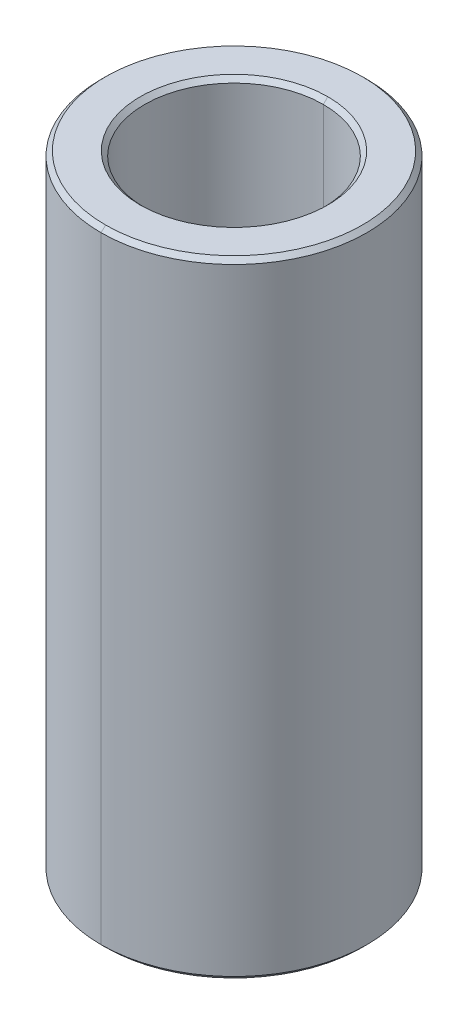
ISO-10303-21;
HEADER;
FILE_DESCRIPTION(('STEP AP214'),'2;1');
FILE_NAME('part.step','',(''),(''),'','','');
FILE_SCHEMA(('AUTOMOTIVE_DESIGN { 1 0 10303 214 1 1 1 1 }'));
ENDSEC;
DATA;
#1=APPLICATION_CONTEXT('core data for automotive mechanical design processes');
#2=APPLICATION_PROTOCOL_DEFINITION('international standard','automotive_design',2000,#1);
#3=PRODUCT_CONTEXT('',#1,'mechanical');
#4=PRODUCT('Part','Part','',(#3));
#5=PRODUCT_RELATED_PRODUCT_CATEGORY('part','',(#4));
#6=PRODUCT_DEFINITION_FORMATION('','',#4);
#7=PRODUCT_DEFINITION_CONTEXT('part definition',#1,'design');
#8=PRODUCT_DEFINITION('design','',#6,#7);
#9=PRODUCT_DEFINITION_SHAPE('','',#8);
#10=(LENGTH_UNIT() NAMED_UNIT(*) SI_UNIT(.MILLI.,.METRE.));
#11=(NAMED_UNIT(*) PLANE_ANGLE_UNIT() SI_UNIT($,.RADIAN.));
#12=(NAMED_UNIT(*) SI_UNIT($,.STERADIAN.) SOLID_ANGLE_UNIT());
#13=UNCERTAINTY_MEASURE_WITH_UNIT(LENGTH_MEASURE(1.E-05),#10,'distance_accuracy_value','');
#14=(GEOMETRIC_REPRESENTATION_CONTEXT(3) GLOBAL_UNCERTAINTY_ASSIGNED_CONTEXT((#13)) GLOBAL_UNIT_ASSIGNED_CONTEXT((#10,
#11,#12)) REPRESENTATION_CONTEXT('',''));
#15=CARTESIAN_POINT('',(0.,0.,0.));
#16=DIRECTION('',(0.,0.,1.));
#17=DIRECTION('',(1.,0.,0.));
#18=AXIS2_PLACEMENT_3D('',#15,#16,#17);
#19=CARTESIAN_POINT('',(0.,6.9,0.));
#20=DIRECTION('',(0.,1.,0.));
#21=DIRECTION('',(0.,0.,1.));
#22=AXIS2_PLACEMENT_3D('',#19,#20,#21);
#23=CONICAL_SURFACE('',#22,2.,0.785398163397448);
#24=DIRECTION('',(0.,0.707106781186548,-0.707106781186548));
#25=VECTOR('',#24,1.);
#26=CARTESIAN_POINT('',(0.,6.9,-2.));
#27=LINE('',#26,#25);
#28=CARTESIAN_POINT('',(0.,6.9,-2.));
#29=VERTEX_POINT('',#28);
#30=CARTESIAN_POINT('',(0.,7.,-2.1));
#31=VERTEX_POINT('',#30);
#32=EDGE_CURVE('E135',#29,#31,#27,.T.);
#33=ORIENTED_EDGE('',*,*,#32,.F.);
#34=CARTESIAN_POINT('',(0.,6.9,0.));
#35=DIRECTION('',(0.,1.,0.));
#36=DIRECTION('',(0.,0.,1.));
#37=AXIS2_PLACEMENT_3D('',#34,#35,#36);
#38=CIRCLE('',#37,2.);
#39=CARTESIAN_POINT('',(0.,6.9,2.));
#40=VERTEX_POINT('',#39);
#41=EDGE_CURVE('E26',#40,#29,#38,.T.);
#42=ORIENTED_EDGE('',*,*,#41,.F.);
#43=DIRECTION('',(0.,0.707106781186548,0.707106781186548));
#44=VECTOR('',#43,1.);
#45=CARTESIAN_POINT('',(0.,6.9,2.));
#46=LINE('',#45,#44);
#47=CARTESIAN_POINT('',(0.,7.,2.1));
#48=VERTEX_POINT('',#47);
#49=EDGE_CURVE('E126',#40,#48,#46,.T.);
#50=ORIENTED_EDGE('',*,*,#49,.T.);
#51=CARTESIAN_POINT('',(0.,7.,0.));
#52=DIRECTION('',(0.,-1.,0.));
#53=DIRECTION('',(0.,0.,1.));
#54=AXIS2_PLACEMENT_3D('',#51,#52,#53);
#55=CIRCLE('',#54,2.1);
#56=EDGE_CURVE('E112',#31,#48,#55,.T.);
#57=ORIENTED_EDGE('',*,*,#56,.F.);
#58=EDGE_LOOP('',(#33,#42,#50,#57));
#59=FACE_BOUND('',#58,.T.);
#60=ADVANCED_FACE('F15',(#59),#23,.F.);
#61=CARTESIAN_POINT('',(0.,-7.,0.));
#62=DIRECTION('',(0.,-1.,0.));
#63=DIRECTION('',(0.,0.,-1.));
#64=AXIS2_PLACEMENT_3D('',#61,#62,#63);
#65=CONICAL_SURFACE('',#64,2.1,0.785398163397457);
#66=DIRECTION('',(0.,-0.707106781186542,0.707106781186554));
#67=VECTOR('',#66,1.);
#68=CARTESIAN_POINT('',(0.,-7.,2.1));
#69=LINE('',#68,#67);
#70=CARTESIAN_POINT('',(0.,-6.9,2.));
#71=VERTEX_POINT('',#70);
#72=CARTESIAN_POINT('',(0.,-7.,2.1));
#73=VERTEX_POINT('',#72);
#74=EDGE_CURVE('E151',#71,#73,#69,.T.);
#75=ORIENTED_EDGE('',*,*,#74,.F.);
#76=CARTESIAN_POINT('',(0.,-6.9,0.));
#77=DIRECTION('',(0.,-1.,0.));
#78=DIRECTION('',(0.,0.,1.));
#79=AXIS2_PLACEMENT_3D('',#76,#77,#78);
#80=CIRCLE('',#79,2.);
#81=CARTESIAN_POINT('',(0.,-6.9,-2.));
#82=VERTEX_POINT('',#81);
#83=EDGE_CURVE('E10',#82,#71,#80,.T.);
#84=ORIENTED_EDGE('',*,*,#83,.F.);
#85=DIRECTION('',(0.,-0.707106781186542,-0.707106781186554));
#86=VECTOR('',#85,1.);
#87=CARTESIAN_POINT('',(0.,-7.,-2.1));
#88=LINE('',#87,#86);
#89=CARTESIAN_POINT('',(0.,-7.,-2.1));
#90=VERTEX_POINT('',#89);
#91=EDGE_CURVE('E150',#82,#90,#88,.T.);
#92=ORIENTED_EDGE('',*,*,#91,.T.);
#93=CARTESIAN_POINT('',(0.,-7.,0.));
#94=DIRECTION('',(0.,1.,0.));
#95=DIRECTION('',(0.,0.,1.));
#96=AXIS2_PLACEMENT_3D('',#93,#94,#95);
#97=CIRCLE('',#96,2.1);
#98=EDGE_CURVE('E80',#73,#90,#97,.T.);
#99=ORIENTED_EDGE('',*,*,#98,.F.);
#100=EDGE_LOOP('',(#75,#84,#92,#99));
#101=FACE_BOUND('',#100,.T.);
#102=ADVANCED_FACE('F17',(#101),#65,.F.);
#103=CARTESIAN_POINT('',(0.,7.,0.));
#104=DIRECTION('',(0.,-1.,0.));
#105=DIRECTION('',(0.,0.,-1.));
#106=AXIS2_PLACEMENT_3D('',#103,#104,#105);
#107=CONICAL_SURFACE('',#106,2.875,0.785398163397448);
#108=DIRECTION('',(0.,-0.707106781186548,0.707106781186548));
#109=VECTOR('',#108,1.);
#110=CARTESIAN_POINT('',(0.,7.,2.875));
#111=LINE('',#110,#109);
#112=CARTESIAN_POINT('',(0.,7.,2.875));
#113=VERTEX_POINT('',#112);
#114=CARTESIAN_POINT('',(0.,6.9,2.975));
#115=VERTEX_POINT('',#114);
#116=EDGE_CURVE('E156',#113,#115,#111,.T.);
#117=ORIENTED_EDGE('',*,*,#116,.F.);
#118=CARTESIAN_POINT('',(0.,7.,0.));
#119=DIRECTION('',(0.,1.,0.));
#120=DIRECTION('',(0.,0.,1.));
#121=AXIS2_PLACEMENT_3D('',#118,#119,#120);
#122=CIRCLE('',#121,2.875);
#123=CARTESIAN_POINT('',(0.,7.,-2.875));
#124=VERTEX_POINT('',#123);
#125=EDGE_CURVE('E123',#124,#113,#122,.T.);
#126=ORIENTED_EDGE('',*,*,#125,.F.);
#127=DIRECTION('',(0.,-0.707106781186548,-0.707106781186548));
#128=VECTOR('',#127,1.);
#129=CARTESIAN_POINT('',(0.,7.,-2.875));
#130=LINE('',#129,#128);
#131=CARTESIAN_POINT('',(0.,6.9,-2.975));
#132=VERTEX_POINT('',#131);
#133=EDGE_CURVE('E161',#124,#132,#130,.T.);
#134=ORIENTED_EDGE('',*,*,#133,.T.);
#135=CARTESIAN_POINT('',(0.,6.9,0.));
#136=DIRECTION('',(0.,-1.,0.));
#137=DIRECTION('',(0.,0.,1.));
#138=AXIS2_PLACEMENT_3D('',#135,#136,#137);
#139=CIRCLE('',#138,2.975);
#140=EDGE_CURVE('E166',#115,#132,#139,.T.);
#141=ORIENTED_EDGE('',*,*,#140,.F.);
#142=EDGE_LOOP('',(#117,#126,#134,#141));
#143=FACE_BOUND('',#142,.T.);
#144=ADVANCED_FACE('F246',(#143),#107,.T.);
#145=CARTESIAN_POINT('',(0.,-6.9,0.));
#146=DIRECTION('',(0.,1.,0.));
#147=DIRECTION('',(0.,0.,1.));
#148=AXIS2_PLACEMENT_3D('',#145,#146,#147);
#149=CONICAL_SURFACE('',#148,2.975,0.785398163397448);
#150=DIRECTION('',(0.,0.707106781186548,-0.707106781186548));
#151=VECTOR('',#150,1.);
#152=CARTESIAN_POINT('',(0.,-6.9,-2.975));
#153=LINE('',#152,#151);
#154=CARTESIAN_POINT('',(0.,-7.,-2.875));
#155=VERTEX_POINT('',#154);
#156=CARTESIAN_POINT('',(0.,-6.9,-2.975));
#157=VERTEX_POINT('',#156);
#158=EDGE_CURVE('E182',#155,#157,#153,.T.);
#159=ORIENTED_EDGE('',*,*,#158,.F.);
#160=CARTESIAN_POINT('',(0.,-7.,0.));
#161=DIRECTION('',(0.,-1.,0.));
#162=DIRECTION('',(0.,0.,1.));
#163=AXIS2_PLACEMENT_3D('',#160,#161,#162);
#164=CIRCLE('',#163,2.875);
#165=CARTESIAN_POINT('',(0.,-7.,2.875));
#166=VERTEX_POINT('',#165);
#167=EDGE_CURVE('E122',#166,#155,#164,.T.);
#168=ORIENTED_EDGE('',*,*,#167,.F.);
#169=DIRECTION('',(0.,0.707106781186548,0.707106781186548));
#170=VECTOR('',#169,1.);
#171=CARTESIAN_POINT('',(0.,-6.9,2.975));
#172=LINE('',#171,#170);
#173=CARTESIAN_POINT('',(0.,-6.9,2.975));
#174=VERTEX_POINT('',#173);
#175=EDGE_CURVE('E181',#166,#174,#172,.T.);
#176=ORIENTED_EDGE('',*,*,#175,.T.);
#177=CARTESIAN_POINT('',(0.,-6.9,0.));
#178=DIRECTION('',(0.,1.,0.));
#179=DIRECTION('',(0.,0.,1.));
#180=AXIS2_PLACEMENT_3D('',#177,#178,#179);
#181=CIRCLE('',#180,2.975);
#182=EDGE_CURVE('E41',#157,#174,#181,.T.);
#183=ORIENTED_EDGE('',*,*,#182,.F.);
#184=EDGE_LOOP('',(#159,#168,#176,#183));
#185=FACE_BOUND('',#184,.T.);
#186=ADVANCED_FACE('F210',(#185),#149,.T.);
#187=CARTESIAN_POINT('',(0.,7.,0.));
#188=DIRECTION('',(0.,-1.,0.));
#189=DIRECTION('',(0.,0.,-1.));
#190=AXIS2_PLACEMENT_3D('',#187,#188,#189);
#191=CYLINDRICAL_SURFACE('',#190,2.);
#192=DIRECTION('',(0.,-1.,0.));
#193=VECTOR('',#192,1.);
#194=CARTESIAN_POINT('',(0.,7.,2.));
#195=LINE('',#194,#193);
#196=EDGE_CURVE('E186',#40,#71,#195,.T.);
#197=ORIENTED_EDGE('',*,*,#196,.F.);
#198=ORIENTED_EDGE('',*,*,#41,.T.);
#199=DIRECTION('',(0.,-1.,0.));
#200=VECTOR('',#199,1.);
#201=CARTESIAN_POINT('',(0.,7.,-2.));
#202=LINE('',#201,#200);
#203=EDGE_CURVE('E217',#29,#82,#202,.T.);
#204=ORIENTED_EDGE('',*,*,#203,.T.);
#205=ORIENTED_EDGE('',*,*,#83,.T.);
#206=EDGE_LOOP('',(#197,#198,#204,#205));
#207=FACE_BOUND('',#206,.T.);
#208=ADVANCED_FACE('F267',(#207),#191,.F.);
#209=CARTESIAN_POINT('',(0.,7.,0.));
#210=DIRECTION('',(0.,-1.,0.));
#211=DIRECTION('',(0.,0.,-1.));
#212=AXIS2_PLACEMENT_3D('',#209,#210,#211);
#213=CYLINDRICAL_SURFACE('',#212,2.975);
#214=DIRECTION('',(0.,-1.,0.));
#215=VECTOR('',#214,1.);
#216=CARTESIAN_POINT('',(0.,7.,2.975));
#217=LINE('',#216,#215);
#218=EDGE_CURVE('E19',#115,#174,#217,.T.);
#219=ORIENTED_EDGE('',*,*,#218,.F.);
#220=ORIENTED_EDGE('',*,*,#140,.T.);
#221=DIRECTION('',(0.,-1.,0.));
#222=VECTOR('',#221,1.);
#223=CARTESIAN_POINT('',(0.,7.,-2.975));
#224=LINE('',#223,#222);
#225=EDGE_CURVE('E145',#132,#157,#224,.T.);
#226=ORIENTED_EDGE('',*,*,#225,.T.);
#227=ORIENTED_EDGE('',*,*,#182,.T.);
#228=EDGE_LOOP('',(#219,#220,#226,#227));
#229=FACE_BOUND('',#228,.T.);
#230=ADVANCED_FACE('F212',(#229),#213,.T.);
#231=CARTESIAN_POINT('',(0.,-7.,0.));
#232=DIRECTION('',(0.,1.,0.));
#233=DIRECTION('',(1.,0.,0.));
#234=AXIS2_PLACEMENT_3D('',#231,#232,#233);
#235=PLANE('',#234);
#236=CARTESIAN_POINT('',(0.,-7.,0.));
#237=DIRECTION('',(0.,1.,0.));
#238=DIRECTION('',(0.,0.,1.));
#239=AXIS2_PLACEMENT_3D('',#236,#237,#238);
#240=CIRCLE('',#239,2.1);
#241=EDGE_CURVE('E147',#90,#73,#240,.T.);
#242=ORIENTED_EDGE('',*,*,#241,.T.);
#243=ORIENTED_EDGE('',*,*,#98,.T.);
#244=EDGE_LOOP('',(#242,#243));
#245=FACE_BOUND('',#244,.T.);
#246=ORIENTED_EDGE('',*,*,#167,.T.);
#247=CARTESIAN_POINT('',(0.,-7.,0.));
#248=DIRECTION('',(0.,-1.,0.));
#249=DIRECTION('',(0.,0.,1.));
#250=AXIS2_PLACEMENT_3D('',#247,#248,#249);
#251=CIRCLE('',#250,2.875);
#252=EDGE_CURVE('E189',#155,#166,#251,.T.);
#253=ORIENTED_EDGE('',*,*,#252,.T.);
#254=EDGE_LOOP('',(#246,#253));
#255=FACE_BOUND('',#254,.T.);
#256=ADVANCED_FACE('F262',(#245,#255),#235,.F.);
#257=CARTESIAN_POINT('',(0.,7.,0.));
#258=DIRECTION('',(0.,1.,0.));
#259=DIRECTION('',(1.,0.,0.));
#260=AXIS2_PLACEMENT_3D('',#257,#258,#259);
#261=PLANE('',#260);
#262=CARTESIAN_POINT('',(0.,7.,0.));
#263=DIRECTION('',(0.,-1.,0.));
#264=DIRECTION('',(0.,0.,1.));
#265=AXIS2_PLACEMENT_3D('',#262,#263,#264);
#266=CIRCLE('',#265,2.1);
#267=EDGE_CURVE('E117',#48,#31,#266,.T.);
#268=ORIENTED_EDGE('',*,*,#267,.T.);
#269=ORIENTED_EDGE('',*,*,#56,.T.);
#270=EDGE_LOOP('',(#268,#269));
#271=FACE_BOUND('',#270,.T.);
#272=ORIENTED_EDGE('',*,*,#125,.T.);
#273=CARTESIAN_POINT('',(0.,7.,0.));
#274=DIRECTION('',(0.,1.,0.));
#275=DIRECTION('',(0.,0.,1.));
#276=AXIS2_PLACEMENT_3D('',#273,#274,#275);
#277=CIRCLE('',#276,2.875);
#278=EDGE_CURVE('E152',#113,#124,#277,.T.);
#279=ORIENTED_EDGE('',*,*,#278,.T.);
#280=EDGE_LOOP('',(#272,#279));
#281=FACE_BOUND('',#280,.T.);
#282=ADVANCED_FACE('F114',(#271,#281),#261,.T.);
#283=CARTESIAN_POINT('',(0.,7.,0.));
#284=DIRECTION('',(0.,-1.,0.));
#285=DIRECTION('',(0.,0.,-1.));
#286=AXIS2_PLACEMENT_3D('',#283,#284,#285);
#287=CYLINDRICAL_SURFACE('',#286,2.975);
#288=CARTESIAN_POINT('',(0.,6.9,0.));
#289=DIRECTION('',(0.,-1.,0.));
#290=DIRECTION('',(0.,0.,1.));
#291=AXIS2_PLACEMENT_3D('',#288,#289,#290);
#292=CIRCLE('',#291,2.975);
#293=EDGE_CURVE('E157',#132,#115,#292,.T.);
#294=ORIENTED_EDGE('',*,*,#293,.T.);
#295=ORIENTED_EDGE('',*,*,#218,.T.);
#296=CARTESIAN_POINT('',(0.,-6.9,0.));
#297=DIRECTION('',(0.,1.,0.));
#298=DIRECTION('',(0.,0.,1.));
#299=AXIS2_PLACEMENT_3D('',#296,#297,#298);
#300=CIRCLE('',#299,2.975);
#301=EDGE_CURVE('E177',#174,#157,#300,.T.);
#302=ORIENTED_EDGE('',*,*,#301,.T.);
#303=ORIENTED_EDGE('',*,*,#225,.F.);
#304=EDGE_LOOP('',(#294,#295,#302,#303));
#305=FACE_BOUND('',#304,.T.);
#306=ADVANCED_FACE('F215',(#305),#287,.T.);
#307=CARTESIAN_POINT('',(0.,7.,0.));
#308=DIRECTION('',(0.,-1.,0.));
#309=DIRECTION('',(0.,0.,-1.));
#310=AXIS2_PLACEMENT_3D('',#307,#308,#309);
#311=CYLINDRICAL_SURFACE('',#310,2.);
#312=CARTESIAN_POINT('',(0.,6.9,0.));
#313=DIRECTION('',(0.,1.,0.));
#314=DIRECTION('',(0.,0.,1.));
#315=AXIS2_PLACEMENT_3D('',#312,#313,#314);
#316=CIRCLE('',#315,2.);
#317=EDGE_CURVE('E142',#29,#40,#316,.T.);
#318=ORIENTED_EDGE('',*,*,#317,.T.);
#319=ORIENTED_EDGE('',*,*,#196,.T.);
#320=CARTESIAN_POINT('',(0.,-6.9,0.));
#321=DIRECTION('',(0.,-1.,0.));
#322=DIRECTION('',(0.,0.,1.));
#323=AXIS2_PLACEMENT_3D('',#320,#321,#322);
#324=CIRCLE('',#323,2.);
#325=EDGE_CURVE('E132',#71,#82,#324,.T.);
#326=ORIENTED_EDGE('',*,*,#325,.T.);
#327=ORIENTED_EDGE('',*,*,#203,.F.);
#328=EDGE_LOOP('',(#318,#319,#326,#327));
#329=FACE_BOUND('',#328,.T.);
#330=ADVANCED_FACE('F240',(#329),#311,.F.);
#331=CARTESIAN_POINT('',(0.,-6.9,0.));
#332=DIRECTION('',(0.,1.,0.));
#333=DIRECTION('',(0.,0.,1.));
#334=AXIS2_PLACEMENT_3D('',#331,#332,#333);
#335=CONICAL_SURFACE('',#334,2.975,0.785398163397448);
#336=ORIENTED_EDGE('',*,*,#252,.F.);
#337=ORIENTED_EDGE('',*,*,#158,.T.);
#338=ORIENTED_EDGE('',*,*,#301,.F.);
#339=ORIENTED_EDGE('',*,*,#175,.F.);
#340=EDGE_LOOP('',(#336,#337,#338,#339));
#341=FACE_BOUND('',#340,.T.);
#342=ADVANCED_FACE('F206',(#341),#335,.T.);
#343=CARTESIAN_POINT('',(0.,7.,0.));
#344=DIRECTION('',(0.,-1.,0.));
#345=DIRECTION('',(0.,0.,-1.));
#346=AXIS2_PLACEMENT_3D('',#343,#344,#345);
#347=CONICAL_SURFACE('',#346,2.875,0.785398163397448);
#348=ORIENTED_EDGE('',*,*,#278,.F.);
#349=ORIENTED_EDGE('',*,*,#116,.T.);
#350=ORIENTED_EDGE('',*,*,#293,.F.);
#351=ORIENTED_EDGE('',*,*,#133,.F.);
#352=EDGE_LOOP('',(#348,#349,#350,#351));
#353=FACE_BOUND('',#352,.T.);
#354=ADVANCED_FACE('F272',(#353),#347,.T.);
#355=CARTESIAN_POINT('',(0.,-7.,0.));
#356=DIRECTION('',(0.,-1.,0.));
#357=DIRECTION('',(0.,0.,-1.));
#358=AXIS2_PLACEMENT_3D('',#355,#356,#357);
#359=CONICAL_SURFACE('',#358,2.1,0.785398163397457);
#360=ORIENTED_EDGE('',*,*,#325,.F.);
#361=ORIENTED_EDGE('',*,*,#74,.T.);
#362=ORIENTED_EDGE('',*,*,#241,.F.);
#363=ORIENTED_EDGE('',*,*,#91,.F.);
#364=EDGE_LOOP('',(#360,#361,#362,#363));
#365=FACE_BOUND('',#364,.T.);
#366=ADVANCED_FACE('F243',(#365),#359,.F.);
#367=CARTESIAN_POINT('',(0.,6.9,0.));
#368=DIRECTION('',(0.,1.,0.));
#369=DIRECTION('',(0.,0.,1.));
#370=AXIS2_PLACEMENT_3D('',#367,#368,#369);
#371=CONICAL_SURFACE('',#370,2.,0.785398163397448);
#372=ORIENTED_EDGE('',*,*,#317,.F.);
#373=ORIENTED_EDGE('',*,*,#32,.T.);
#374=ORIENTED_EDGE('',*,*,#267,.F.);
#375=ORIENTED_EDGE('',*,*,#49,.F.);
#376=EDGE_LOOP('',(#372,#373,#374,#375));
#377=FACE_BOUND('',#376,.T.);
#378=ADVANCED_FACE('F134',(#377),#371,.F.);
#379=CLOSED_SHELL('',(#60,#102,#144,#186,#208,#230,#256,#282,#306,#330,#342,#354,#366,#378));
#380=MANIFOLD_SOLID_BREP('B1',#379);
#381=ADVANCED_BREP_SHAPE_REPRESENTATION('',(#18,#380),#14);
#382=SHAPE_DEFINITION_REPRESENTATION(#9,#381);
ENDSEC;
END-ISO-10303-21;
